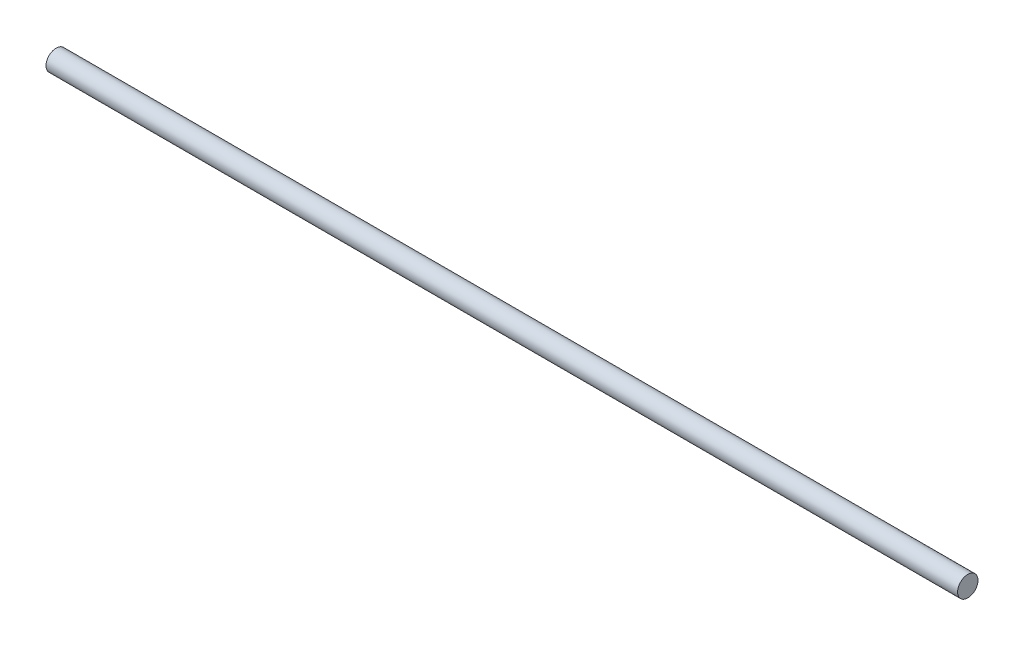
ISO-10303-21;
HEADER;
FILE_DESCRIPTION(('STEP AP214'),'2;1');
FILE_NAME('part.step','',(''),(''),'','','');
FILE_SCHEMA(('AUTOMOTIVE_DESIGN { 1 0 10303 214 1 1 1 1 }'));
ENDSEC;
DATA;
#1=APPLICATION_CONTEXT('core data for automotive mechanical design processes');
#2=APPLICATION_PROTOCOL_DEFINITION('international standard','automotive_design',2000,#1);
#3=PRODUCT_CONTEXT('',#1,'mechanical');
#4=PRODUCT('Part','Part','',(#3));
#5=PRODUCT_RELATED_PRODUCT_CATEGORY('part','',(#4));
#6=PRODUCT_DEFINITION_FORMATION('','',#4);
#7=PRODUCT_DEFINITION_CONTEXT('part definition',#1,'design');
#8=PRODUCT_DEFINITION('design','',#6,#7);
#9=PRODUCT_DEFINITION_SHAPE('','',#8);
#10=(LENGTH_UNIT() NAMED_UNIT(*) SI_UNIT(.MILLI.,.METRE.));
#11=(NAMED_UNIT(*) PLANE_ANGLE_UNIT() SI_UNIT($,.RADIAN.));
#12=(NAMED_UNIT(*) SI_UNIT($,.STERADIAN.) SOLID_ANGLE_UNIT());
#13=UNCERTAINTY_MEASURE_WITH_UNIT(LENGTH_MEASURE(1.E-05),#10,'distance_accuracy_value','');
#14=(GEOMETRIC_REPRESENTATION_CONTEXT(3) GLOBAL_UNCERTAINTY_ASSIGNED_CONTEXT((#13)) GLOBAL_UNIT_ASSIGNED_CONTEXT((#10,
#11,#12)) REPRESENTATION_CONTEXT('',''));
#15=CARTESIAN_POINT('',(0.,0.,0.));
#16=DIRECTION('',(0.,0.,1.));
#17=DIRECTION('',(1.,0.,0.));
#18=AXIS2_PLACEMENT_3D('',#15,#16,#17);
#19=CARTESIAN_POINT('',(0.,0.,0.));
#20=DIRECTION('',(-1.,0.,0.));
#21=DIRECTION('',(0.,0.,1.));
#22=AXIS2_PLACEMENT_3D('',#19,#20,#21);
#23=PLANE('',#22);
#24=CARTESIAN_POINT('',(0.,0.,0.));
#25=DIRECTION('',(-1.,0.,0.));
#26=DIRECTION('',(0.,0.,1.));
#27=AXIS2_PLACEMENT_3D('',#24,#25,#26);
#28=CIRCLE('',#27,1.5);
#29=CARTESIAN_POINT('',(0.,0.,1.5));
#30=VERTEX_POINT('',#29);
#31=EDGE_CURVE('E10',#30,#30,#28,.T.);
#32=ORIENTED_EDGE('',*,*,#31,.T.);
#33=EDGE_LOOP('',(#32));
#34=FACE_BOUND('',#33,.T.);
#35=ADVANCED_FACE('F31',(#34),#23,.T.);
#36=CARTESIAN_POINT('',(0.,0.,0.));
#37=DIRECTION('',(-1.,0.,0.));
#38=DIRECTION('',(0.,0.,1.));
#39=AXIS2_PLACEMENT_3D('',#36,#37,#38);
#40=CYLINDRICAL_SURFACE('',#39,1.5);
#41=CARTESIAN_POINT('',(134.,0.,0.));
#42=DIRECTION('',(-1.,0.,0.));
#43=DIRECTION('',(0.,0.,1.));
#44=AXIS2_PLACEMENT_3D('',#41,#42,#43);
#45=CIRCLE('',#44,1.5);
#46=CARTESIAN_POINT('',(134.,0.,1.5));
#47=VERTEX_POINT('',#46);
#48=EDGE_CURVE('E37',#47,#47,#45,.T.);
#49=ORIENTED_EDGE('',*,*,#48,.T.);
#50=EDGE_LOOP('',(#49));
#51=FACE_BOUND('',#50,.T.);
#52=ORIENTED_EDGE('',*,*,#31,.F.);
#53=EDGE_LOOP('',(#52));
#54=FACE_BOUND('',#53,.T.);
#55=ADVANCED_FACE('F43',(#51,#54),#40,.T.);
#56=CARTESIAN_POINT('',(134.,0.,0.));
#57=DIRECTION('',(1.,0.,0.));
#58=DIRECTION('',(0.,0.,-1.));
#59=AXIS2_PLACEMENT_3D('',#56,#57,#58);
#60=PLANE('',#59);
#61=ORIENTED_EDGE('',*,*,#48,.F.);
#62=EDGE_LOOP('',(#61));
#63=FACE_BOUND('',#62,.T.);
#64=ADVANCED_FACE('F46',(#63),#60,.T.);
#65=CLOSED_SHELL('',(#35,#55,#64));
#66=MANIFOLD_SOLID_BREP('B2',#65);
#67=ADVANCED_BREP_SHAPE_REPRESENTATION('',(#18,#66),#14);
#68=SHAPE_DEFINITION_REPRESENTATION(#9,#67);
ENDSEC;
END-ISO-10303-21;
